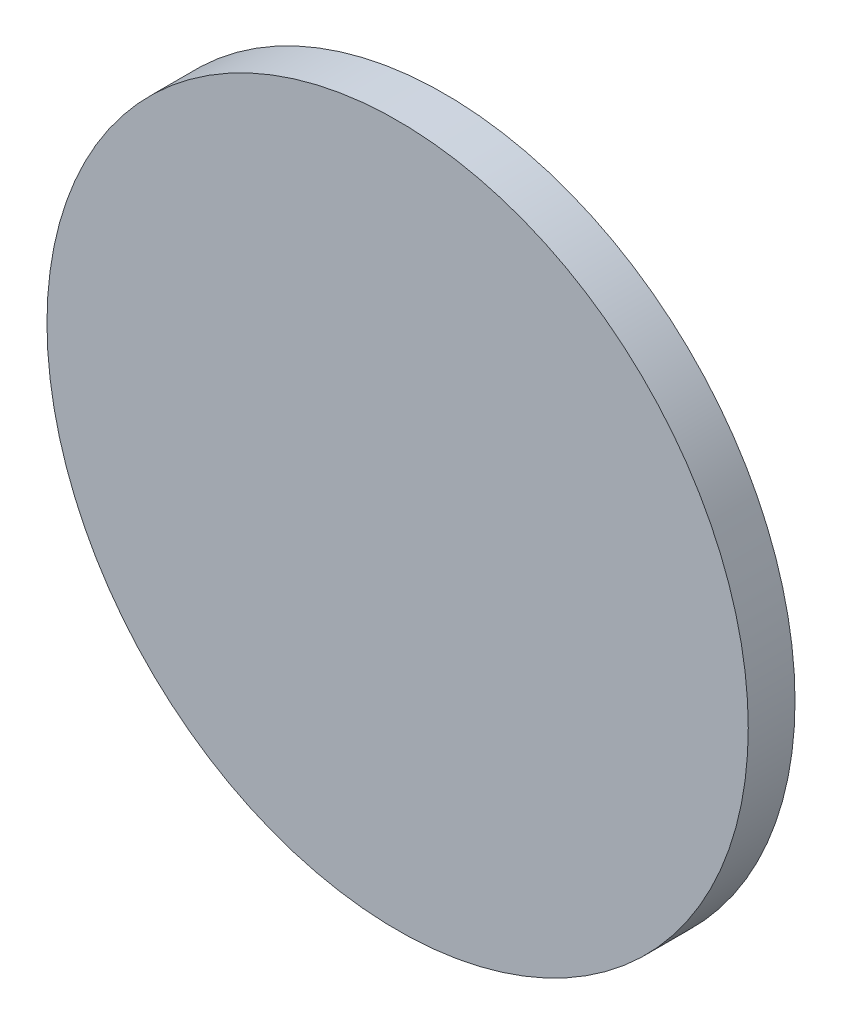
ISO-10303-21;
HEADER;
FILE_DESCRIPTION(('STEP AP214'),'2;1');
FILE_NAME('part.step','',(''),(''),'','','');
FILE_SCHEMA(('AUTOMOTIVE_DESIGN { 1 0 10303 214 1 1 1 1 }'));
ENDSEC;
DATA;
#1=APPLICATION_CONTEXT('core data for automotive mechanical design processes');
#2=APPLICATION_PROTOCOL_DEFINITION('international standard','automotive_design',2000,#1);
#3=PRODUCT_CONTEXT('',#1,'mechanical');
#4=PRODUCT('Part','Part','',(#3));
#5=PRODUCT_RELATED_PRODUCT_CATEGORY('part','',(#4));
#6=PRODUCT_DEFINITION_FORMATION('','',#4);
#7=PRODUCT_DEFINITION_CONTEXT('part definition',#1,'design');
#8=PRODUCT_DEFINITION('design','',#6,#7);
#9=PRODUCT_DEFINITION_SHAPE('','',#8);
#10=(LENGTH_UNIT() NAMED_UNIT(*) SI_UNIT(.MILLI.,.METRE.));
#11=(NAMED_UNIT(*) PLANE_ANGLE_UNIT() SI_UNIT($,.RADIAN.));
#12=(NAMED_UNIT(*) SI_UNIT($,.STERADIAN.) SOLID_ANGLE_UNIT());
#13=UNCERTAINTY_MEASURE_WITH_UNIT(LENGTH_MEASURE(1.E-05),#10,'distance_accuracy_value','');
#14=(GEOMETRIC_REPRESENTATION_CONTEXT(3) GLOBAL_UNCERTAINTY_ASSIGNED_CONTEXT((#13)) GLOBAL_UNIT_ASSIGNED_CONTEXT((#10,
#11,#12)) REPRESENTATION_CONTEXT('',''));
#15=CARTESIAN_POINT('',(0.,0.,0.));
#16=DIRECTION('',(0.,0.,1.));
#17=DIRECTION('',(1.,0.,0.));
#18=AXIS2_PLACEMENT_3D('',#15,#16,#17);
#19=CARTESIAN_POINT('',(0.,0.,3.));
#20=DIRECTION('',(0.,0.,-1.));
#21=DIRECTION('',(-1.,0.,0.));
#22=AXIS2_PLACEMENT_3D('',#19,#20,#21);
#23=CYLINDRICAL_SURFACE('',#22,22.5);
#24=CARTESIAN_POINT('',(0.,0.,3.));
#25=DIRECTION('',(0.,0.,1.));
#26=DIRECTION('',(1.,0.,0.));
#27=AXIS2_PLACEMENT_3D('',#24,#25,#26);
#28=CIRCLE('',#27,22.5);
#29=CARTESIAN_POINT('',(22.5,0.,3.));
#30=VERTEX_POINT('',#29);
#31=EDGE_CURVE('E10',#30,#30,#28,.T.);
#32=ORIENTED_EDGE('',*,*,#31,.F.);
#33=EDGE_LOOP('',(#32));
#34=FACE_BOUND('',#33,.T.);
#35=CARTESIAN_POINT('',(0.,0.,0.));
#36=DIRECTION('',(0.,0.,1.));
#37=DIRECTION('',(1.,0.,0.));
#38=AXIS2_PLACEMENT_3D('',#35,#36,#37);
#39=CIRCLE('',#38,22.5);
#40=CARTESIAN_POINT('',(22.5,0.,0.));
#41=VERTEX_POINT('',#40);
#42=EDGE_CURVE('E34',#41,#41,#39,.T.);
#43=ORIENTED_EDGE('',*,*,#42,.T.);
#44=EDGE_LOOP('',(#43));
#45=FACE_BOUND('',#44,.T.);
#46=ADVANCED_FACE('F31',(#34,#45),#23,.T.);
#47=CARTESIAN_POINT('',(0.,0.,3.));
#48=DIRECTION('',(0.,0.,1.));
#49=DIRECTION('',(1.,0.,0.));
#50=AXIS2_PLACEMENT_3D('',#47,#48,#49);
#51=PLANE('',#50);
#52=ORIENTED_EDGE('',*,*,#31,.T.);
#53=EDGE_LOOP('',(#52));
#54=FACE_BOUND('',#53,.T.);
#55=ADVANCED_FACE('F46',(#54),#51,.T.);
#56=CARTESIAN_POINT('',(0.,0.,0.));
#57=DIRECTION('',(0.,0.,1.));
#58=DIRECTION('',(1.,0.,0.));
#59=AXIS2_PLACEMENT_3D('',#56,#57,#58);
#60=PLANE('',#59);
#61=ORIENTED_EDGE('',*,*,#42,.F.);
#62=EDGE_LOOP('',(#61));
#63=FACE_BOUND('',#62,.T.);
#64=ADVANCED_FACE('F44',(#63),#60,.F.);
#65=CLOSED_SHELL('',(#46,#55,#64));
#66=MANIFOLD_SOLID_BREP('B2',#65);
#67=ADVANCED_BREP_SHAPE_REPRESENTATION('',(#18,#66),#14);
#68=SHAPE_DEFINITION_REPRESENTATION(#9,#67);
ENDSEC;
END-ISO-10303-21;
